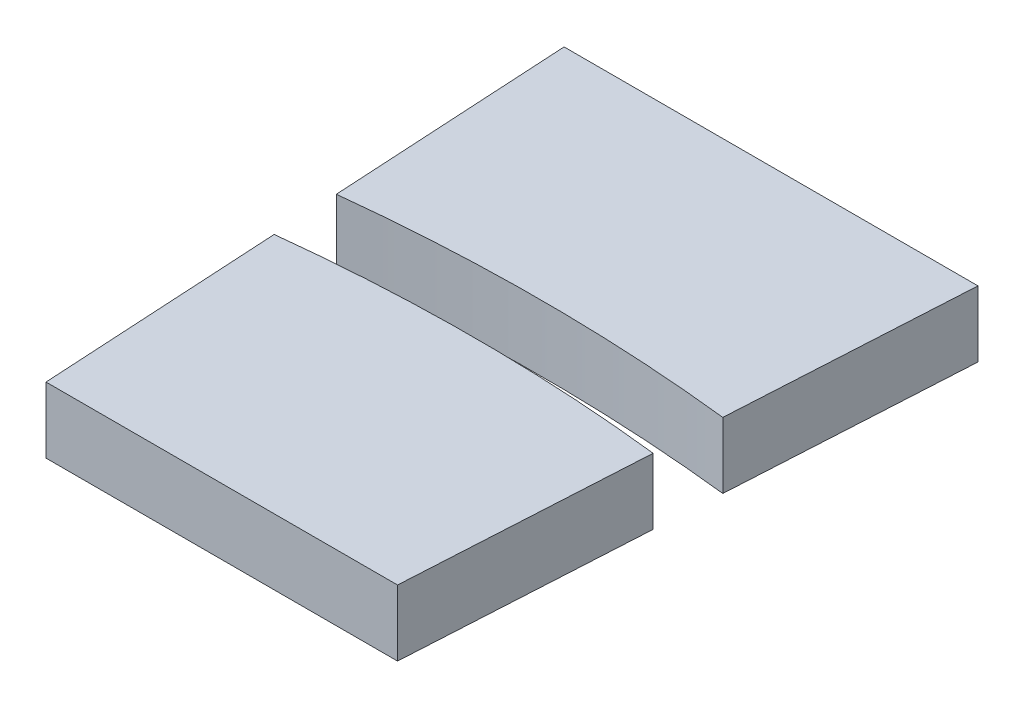
ISO-10303-21;
HEADER;
FILE_DESCRIPTION(('STEP AP214'),'2;1');
FILE_NAME('part.step','',(''),(''),'','','');
FILE_SCHEMA(('AUTOMOTIVE_DESIGN { 1 0 10303 214 1 1 1 1 }'));
ENDSEC;
DATA;
#1=APPLICATION_CONTEXT('core data for automotive mechanical design processes');
#2=APPLICATION_PROTOCOL_DEFINITION('international standard','automotive_design',2000,#1);
#3=PRODUCT_CONTEXT('',#1,'mechanical');
#4=PRODUCT('Part','Part','',(#3));
#5=PRODUCT_RELATED_PRODUCT_CATEGORY('part','',(#4));
#6=PRODUCT_DEFINITION_FORMATION('','',#4);
#7=PRODUCT_DEFINITION_CONTEXT('part definition',#1,'design');
#8=PRODUCT_DEFINITION('design','',#6,#7);
#9=PRODUCT_DEFINITION_SHAPE('','',#8);
#10=(LENGTH_UNIT() NAMED_UNIT(*) SI_UNIT(.MILLI.,.METRE.));
#11=(NAMED_UNIT(*) PLANE_ANGLE_UNIT() SI_UNIT($,.RADIAN.));
#12=(NAMED_UNIT(*) SI_UNIT($,.STERADIAN.) SOLID_ANGLE_UNIT());
#13=UNCERTAINTY_MEASURE_WITH_UNIT(LENGTH_MEASURE(1.E-05),#10,'distance_accuracy_value','');
#14=(GEOMETRIC_REPRESENTATION_CONTEXT(3) GLOBAL_UNCERTAINTY_ASSIGNED_CONTEXT((#13)) GLOBAL_UNIT_ASSIGNED_CONTEXT((#10,
#11,#12)) REPRESENTATION_CONTEXT('',''));
#15=CARTESIAN_POINT('',(0.,0.,0.));
#16=DIRECTION('',(0.,0.,1.));
#17=DIRECTION('',(1.,0.,0.));
#18=AXIS2_PLACEMENT_3D('',#15,#16,#17);
#19=CARTESIAN_POINT('',(-9.41960287819031,3.,-89.5));
#20=DIRECTION('',(0.998391670557349,0.,-0.0566927875633779));
#21=DIRECTION('',(-0.0566927875633779,0.,-0.998391670557349));
#22=AXIS2_PLACEMENT_3D('',#19,#20,#21);
#23=PLANE('',#22);
#24=DIRECTION('',(0.0566927875633779,0.,0.998391670557349));
#25=VECTOR('',#24,1.);
#26=CARTESIAN_POINT('',(-9.41960287819031,0.,-89.5));
#27=LINE('',#26,#25);
#28=CARTESIAN_POINT('',(-9.41960287819031,0.,-89.5));
#29=VERTEX_POINT('',#28);
#30=CARTESIAN_POINT('',(-8.79548015141648,0.,-78.5088500037164));
#31=VERTEX_POINT('',#30);
#32=EDGE_CURVE('E77',#29,#31,#27,.T.);
#33=ORIENTED_EDGE('',*,*,#32,.T.);
#34=DIRECTION('',(0.,1.,0.));
#35=VECTOR('',#34,1.);
#36=CARTESIAN_POINT('',(-8.79548015141648,0.,-78.5088500037164));
#37=LINE('',#36,#35);
#38=CARTESIAN_POINT('',(-8.79548015141648,3.,-78.5088500037164));
#39=VERTEX_POINT('',#38);
#40=EDGE_CURVE('E86',#31,#39,#37,.T.);
#41=ORIENTED_EDGE('',*,*,#40,.T.);
#42=DIRECTION('',(0.0566927875633779,0.,0.998391670557349));
#43=VECTOR('',#42,1.);
#44=CARTESIAN_POINT('',(-9.41960287819031,3.,-89.5));
#45=LINE('',#44,#43);
#46=CARTESIAN_POINT('',(-9.41960287819031,3.,-89.5));
#47=VERTEX_POINT('',#46);
#48=EDGE_CURVE('E91',#47,#39,#45,.T.);
#49=ORIENTED_EDGE('',*,*,#48,.F.);
#50=DIRECTION('',(0.,-1.,0.));
#51=VECTOR('',#50,1.);
#52=CARTESIAN_POINT('',(-9.41960287819031,3.,-89.5));
#53=LINE('',#52,#51);
#54=EDGE_CURVE('E89',#47,#29,#53,.T.);
#55=ORIENTED_EDGE('',*,*,#54,.T.);
#56=EDGE_LOOP('',(#33,#41,#49,#55));
#57=FACE_BOUND('',#56,.T.);
#58=ADVANCED_FACE('F42',(#57),#23,.F.);
#59=CARTESIAN_POINT('',(0.,3.,0.));
#60=DIRECTION('',(0.,-1.,0.));
#61=DIRECTION('',(0.,0.,-1.));
#62=AXIS2_PLACEMENT_3D('',#59,#60,#61);
#63=PLANE('',#62);
#64=ORIENTED_EDGE('',*,*,#48,.T.);
#65=CARTESIAN_POINT('',(0.,3.,0.));
#66=DIRECTION('',(0.,1.,0.));
#67=DIRECTION('',(0.,0.,1.));
#68=AXIS2_PLACEMENT_3D('',#65,#66,#67);
#69=CIRCLE('',#68,79.);
#70=CARTESIAN_POINT('',(8.79548015141648,3.,-78.5088500037164));
#71=VERTEX_POINT('',#70);
#72=EDGE_CURVE('E12',#71,#39,#69,.T.);
#73=ORIENTED_EDGE('',*,*,#72,.F.);
#74=DIRECTION('',(-0.0566927875633779,0.,0.998391670557349));
#75=VECTOR('',#74,1.);
#76=CARTESIAN_POINT('',(9.41960287819031,3.,-89.5));
#77=LINE('',#76,#75);
#78=CARTESIAN_POINT('',(9.41960287819031,3.,-89.5));
#79=VERTEX_POINT('',#78);
#80=EDGE_CURVE('E99',#79,#71,#77,.T.);
#81=ORIENTED_EDGE('',*,*,#80,.F.);
#82=DIRECTION('',(-1.,0.,0.));
#83=VECTOR('',#82,1.);
#84=CARTESIAN_POINT('',(-9.41960287819031,3.,-89.5));
#85=LINE('',#84,#83);
#86=EDGE_CURVE('E105',#79,#47,#85,.T.);
#87=ORIENTED_EDGE('',*,*,#86,.T.);
#88=EDGE_LOOP('',(#64,#73,#81,#87));
#89=FACE_BOUND('',#88,.T.);
#90=ADVANCED_FACE('F112',(#89),#63,.F.);
#91=CARTESIAN_POINT('',(0.,0.,0.));
#92=DIRECTION('',(0.,-1.,0.));
#93=DIRECTION('',(0.,0.,-1.));
#94=AXIS2_PLACEMENT_3D('',#91,#92,#93);
#95=PLANE('',#94);
#96=CARTESIAN_POINT('',(0.,0.,0.));
#97=DIRECTION('',(0.,1.,0.));
#98=DIRECTION('',(0.,0.,-1.));
#99=AXIS2_PLACEMENT_3D('',#96,#97,#98);
#100=CIRCLE('',#99,79.);
#101=CARTESIAN_POINT('',(8.79548015141648,0.,-78.5088500037163));
#102=VERTEX_POINT('',#101);
#103=EDGE_CURVE('E84',#102,#31,#100,.T.);
#104=ORIENTED_EDGE('',*,*,#103,.T.);
#105=ORIENTED_EDGE('',*,*,#32,.F.);
#106=DIRECTION('',(-1.,0.,0.));
#107=VECTOR('',#106,1.);
#108=CARTESIAN_POINT('',(-9.41960287819031,0.,-89.5));
#109=LINE('',#108,#107);
#110=CARTESIAN_POINT('',(9.41960287819031,0.,-89.5));
#111=VERTEX_POINT('',#110);
#112=EDGE_CURVE('E82',#111,#29,#109,.T.);
#113=ORIENTED_EDGE('',*,*,#112,.F.);
#114=DIRECTION('',(-0.0566927875633779,0.,0.998391670557349));
#115=VECTOR('',#114,1.);
#116=CARTESIAN_POINT('',(9.41960287819031,0.,-89.5));
#117=LINE('',#116,#115);
#118=EDGE_CURVE('E103',#111,#102,#117,.T.);
#119=ORIENTED_EDGE('',*,*,#118,.T.);
#120=EDGE_LOOP('',(#104,#105,#113,#119));
#121=FACE_BOUND('',#120,.T.);
#122=ADVANCED_FACE('F79',(#121),#95,.T.);
#123=CARTESIAN_POINT('',(9.41960287819031,3.,-89.5));
#124=DIRECTION('',(0.998391670557349,0.,0.0566927875633779));
#125=DIRECTION('',(0.0566927875633779,0.,-0.998391670557349));
#126=AXIS2_PLACEMENT_3D('',#123,#124,#125);
#127=PLANE('',#126);
#128=DIRECTION('',(0.,1.,0.));
#129=VECTOR('',#128,1.);
#130=CARTESIAN_POINT('',(8.79548015141648,0.,-78.5088500037164));
#131=LINE('',#130,#129);
#132=EDGE_CURVE('E49',#102,#71,#131,.T.);
#133=ORIENTED_EDGE('',*,*,#132,.F.);
#134=ORIENTED_EDGE('',*,*,#118,.F.);
#135=DIRECTION('',(0.,-1.,0.));
#136=VECTOR('',#135,1.);
#137=CARTESIAN_POINT('',(9.41960287819031,3.,-89.5));
#138=LINE('',#137,#136);
#139=EDGE_CURVE('E97',#79,#111,#138,.T.);
#140=ORIENTED_EDGE('',*,*,#139,.F.);
#141=ORIENTED_EDGE('',*,*,#80,.T.);
#142=EDGE_LOOP('',(#133,#134,#140,#141));
#143=FACE_BOUND('',#142,.T.);
#144=ADVANCED_FACE('F115',(#143),#127,.T.);
#145=CARTESIAN_POINT('',(-9.41960287819031,3.,-89.5));
#146=DIRECTION('',(0.,0.,1.));
#147=DIRECTION('',(1.,0.,0.));
#148=AXIS2_PLACEMENT_3D('',#145,#146,#147);
#149=PLANE('',#148);
#150=ORIENTED_EDGE('',*,*,#112,.T.);
#151=ORIENTED_EDGE('',*,*,#54,.F.);
#152=ORIENTED_EDGE('',*,*,#86,.F.);
#153=ORIENTED_EDGE('',*,*,#139,.T.);
#154=EDGE_LOOP('',(#150,#151,#152,#153));
#155=FACE_BOUND('',#154,.T.);
#156=ADVANCED_FACE('F95',(#155),#149,.F.);
#157=CARTESIAN_POINT('',(0.,0.,0.));
#158=DIRECTION('',(0.,1.,0.));
#159=DIRECTION('',(0.,0.,1.));
#160=AXIS2_PLACEMENT_3D('',#157,#158,#159);
#161=CYLINDRICAL_SURFACE('',#160,79.);
#162=ORIENTED_EDGE('',*,*,#40,.F.);
#163=ORIENTED_EDGE('',*,*,#103,.F.);
#164=ORIENTED_EDGE('',*,*,#132,.T.);
#165=ORIENTED_EDGE('',*,*,#72,.T.);
#166=EDGE_LOOP('',(#162,#163,#164,#165));
#167=FACE_BOUND('',#166,.T.);
#168=ADVANCED_FACE('F122',(#167),#161,.F.);
#169=CLOSED_SHELL('',(#58,#90,#122,#144,#156,#168));
#170=MANIFOLD_SOLID_BREP('B2',#169);
#171=CARTESIAN_POINT('',(0.,3.,-64.5));
#172=DIRECTION('',(0.,0.,-1.));
#173=DIRECTION('',(-1.,0.,0.));
#174=AXIS2_PLACEMENT_3D('',#171,#172,#173);
#175=PLANE('',#174);
#176=DIRECTION('',(1.,0.,0.));
#177=VECTOR('',#176,1.);
#178=CARTESIAN_POINT('',(0.,0.,-64.5));
#179=LINE('',#178,#177);
#180=CARTESIAN_POINT('',(-8.,0.,-64.5));
#181=VERTEX_POINT('',#180);
#182=CARTESIAN_POINT('',(8.,0.,-64.5));
#183=VERTEX_POINT('',#182);
#184=EDGE_CURVE('E234',#181,#183,#179,.T.);
#185=ORIENTED_EDGE('',*,*,#184,.T.);
#186=DIRECTION('',(0.,-1.,0.));
#187=VECTOR('',#186,1.);
#188=CARTESIAN_POINT('',(8.,3.,-64.5));
#189=LINE('',#188,#187);
#190=CARTESIAN_POINT('',(8.,3.,-64.5));
#191=VERTEX_POINT('',#190);
#192=EDGE_CURVE('E225',#191,#183,#189,.T.);
#193=ORIENTED_EDGE('',*,*,#192,.F.);
#194=DIRECTION('',(1.,0.,0.));
#195=VECTOR('',#194,1.);
#196=CARTESIAN_POINT('',(0.,3.,-64.5));
#197=LINE('',#196,#195);
#198=CARTESIAN_POINT('',(-8.,3.,-64.5));
#199=VERTEX_POINT('',#198);
#200=EDGE_CURVE('E184',#199,#191,#197,.T.);
#201=ORIENTED_EDGE('',*,*,#200,.F.);
#202=DIRECTION('',(0.,-1.,0.));
#203=VECTOR('',#202,1.);
#204=CARTESIAN_POINT('',(-8.,3.,-64.5));
#205=LINE('',#204,#203);
#206=EDGE_CURVE('E40',#199,#181,#205,.T.);
#207=ORIENTED_EDGE('',*,*,#206,.T.);
#208=EDGE_LOOP('',(#185,#193,#201,#207));
#209=FACE_BOUND('',#208,.T.);
#210=ADVANCED_FACE('F175',(#209),#175,.F.);
#211=CARTESIAN_POINT('',(9.41960287819031,3.,-89.5));
#212=DIRECTION('',(0.998391670557349,0.,0.0566927875633779));
#213=DIRECTION('',(0.0566927875633779,0.,-0.998391670557349));
#214=AXIS2_PLACEMENT_3D('',#211,#212,#213);
#215=PLANE('',#214);
#216=DIRECTION('',(0.,1.,0.));
#217=VECTOR('',#216,1.);
#218=CARTESIAN_POINT('',(8.62513555475054,0.,-75.5089864629514));
#219=LINE('',#218,#217);
#220=CARTESIAN_POINT('',(8.62513555475054,0.,-75.5089864629514));
#221=VERTEX_POINT('',#220);
#222=CARTESIAN_POINT('',(8.62513555475055,3.,-75.5089864629514));
#223=VERTEX_POINT('',#222);
#224=EDGE_CURVE('E214',#221,#223,#219,.T.);
#225=ORIENTED_EDGE('',*,*,#224,.T.);
#226=DIRECTION('',(-0.0566927875633779,0.,0.998391670557349));
#227=VECTOR('',#226,1.);
#228=CARTESIAN_POINT('',(9.41960287819031,3.,-89.5));
#229=LINE('',#228,#227);
#230=EDGE_CURVE('E221',#223,#191,#229,.T.);
#231=ORIENTED_EDGE('',*,*,#230,.T.);
#232=ORIENTED_EDGE('',*,*,#192,.T.);
#233=DIRECTION('',(-0.0566927875633779,0.,0.998391670557349));
#234=VECTOR('',#233,1.);
#235=CARTESIAN_POINT('',(9.41960287819031,0.,-89.5));
#236=LINE('',#235,#234);
#237=EDGE_CURVE('E226',#221,#183,#236,.T.);
#238=ORIENTED_EDGE('',*,*,#237,.F.);
#239=EDGE_LOOP('',(#225,#231,#232,#238));
#240=FACE_BOUND('',#239,.T.);
#241=ADVANCED_FACE('F222',(#240),#215,.T.);
#242=CARTESIAN_POINT('',(0.,0.,0.));
#243=DIRECTION('',(0.,-1.,0.));
#244=DIRECTION('',(0.,0.,-1.));
#245=AXIS2_PLACEMENT_3D('',#242,#243,#244);
#246=PLANE('',#245);
#247=CARTESIAN_POINT('',(0.,0.,0.));
#248=DIRECTION('',(0.,-1.,0.));
#249=DIRECTION('',(0.,0.,-1.));
#250=AXIS2_PLACEMENT_3D('',#247,#248,#249);
#251=CIRCLE('',#250,76.);
#252=CARTESIAN_POINT('',(-8.62513555475055,0.,-75.5089864629514));
#253=VERTEX_POINT('',#252);
#254=EDGE_CURVE('E243',#253,#221,#251,.T.);
#255=ORIENTED_EDGE('',*,*,#254,.T.);
#256=ORIENTED_EDGE('',*,*,#237,.T.);
#257=ORIENTED_EDGE('',*,*,#184,.F.);
#258=DIRECTION('',(0.0566927875633779,0.,0.998391670557349));
#259=VECTOR('',#258,1.);
#260=CARTESIAN_POINT('',(-9.41960287819031,0.,-89.5));
#261=LINE('',#260,#259);
#262=EDGE_CURVE('E235',#253,#181,#261,.T.);
#263=ORIENTED_EDGE('',*,*,#262,.F.);
#264=EDGE_LOOP('',(#255,#256,#257,#263));
#265=FACE_BOUND('',#264,.T.);
#266=ADVANCED_FACE('F247',(#265),#246,.T.);
#267=CARTESIAN_POINT('',(0.,3.,0.));
#268=DIRECTION('',(0.,-1.,0.));
#269=DIRECTION('',(0.,0.,-1.));
#270=AXIS2_PLACEMENT_3D('',#267,#268,#269);
#271=PLANE('',#270);
#272=ORIENTED_EDGE('',*,*,#230,.F.);
#273=CARTESIAN_POINT('',(0.,3.,0.));
#274=DIRECTION('',(0.,1.,0.));
#275=DIRECTION('',(0.,0.,1.));
#276=AXIS2_PLACEMENT_3D('',#273,#274,#275);
#277=CIRCLE('',#276,76.);
#278=CARTESIAN_POINT('',(-8.62513555475055,3.,-75.5089864629514));
#279=VERTEX_POINT('',#278);
#280=EDGE_CURVE('E179',#279,#223,#277,.F.);
#281=ORIENTED_EDGE('',*,*,#280,.F.);
#282=DIRECTION('',(0.0566927875633779,0.,0.998391670557349));
#283=VECTOR('',#282,1.);
#284=CARTESIAN_POINT('',(-9.41960287819031,3.,-89.5));
#285=LINE('',#284,#283);
#286=EDGE_CURVE('E198',#279,#199,#285,.T.);
#287=ORIENTED_EDGE('',*,*,#286,.T.);
#288=ORIENTED_EDGE('',*,*,#200,.T.);
#289=EDGE_LOOP('',(#272,#281,#287,#288));
#290=FACE_BOUND('',#289,.T.);
#291=ADVANCED_FACE('F229',(#290),#271,.F.);
#292=CARTESIAN_POINT('',(-9.41960287819031,3.,-89.5));
#293=DIRECTION('',(0.998391670557349,0.,-0.0566927875633779));
#294=DIRECTION('',(-0.0566927875633779,0.,-0.998391670557349));
#295=AXIS2_PLACEMENT_3D('',#292,#293,#294);
#296=PLANE('',#295);
#297=ORIENTED_EDGE('',*,*,#286,.F.);
#298=DIRECTION('',(0.,1.,0.));
#299=VECTOR('',#298,1.);
#300=CARTESIAN_POINT('',(-8.62513555475055,0.,-75.5089864629514));
#301=LINE('',#300,#299);
#302=EDGE_CURVE('E210',#253,#279,#301,.T.);
#303=ORIENTED_EDGE('',*,*,#302,.F.);
#304=ORIENTED_EDGE('',*,*,#262,.T.);
#305=ORIENTED_EDGE('',*,*,#206,.F.);
#306=EDGE_LOOP('',(#297,#303,#304,#305));
#307=FACE_BOUND('',#306,.T.);
#308=ADVANCED_FACE('F177',(#307),#296,.F.);
#309=CARTESIAN_POINT('',(0.,0.,0.));
#310=DIRECTION('',(0.,1.,0.));
#311=DIRECTION('',(0.,0.,1.));
#312=AXIS2_PLACEMENT_3D('',#309,#310,#311);
#313=CYLINDRICAL_SURFACE('',#312,76.);
#314=ORIENTED_EDGE('',*,*,#224,.F.);
#315=ORIENTED_EDGE('',*,*,#254,.F.);
#316=ORIENTED_EDGE('',*,*,#302,.T.);
#317=ORIENTED_EDGE('',*,*,#280,.T.);
#318=EDGE_LOOP('',(#314,#315,#316,#317));
#319=FACE_BOUND('',#318,.T.);
#320=ADVANCED_FACE('F248',(#319),#313,.T.);
#321=CLOSED_SHELL('',(#210,#241,#266,#291,#308,#320));
#322=MANIFOLD_SOLID_BREP('B6',#321);
#323=ADVANCED_BREP_SHAPE_REPRESENTATION('',(#18,#170,#322),#14);
#324=SHAPE_DEFINITION_REPRESENTATION(#9,#323);
ENDSEC;
END-ISO-10303-21;
